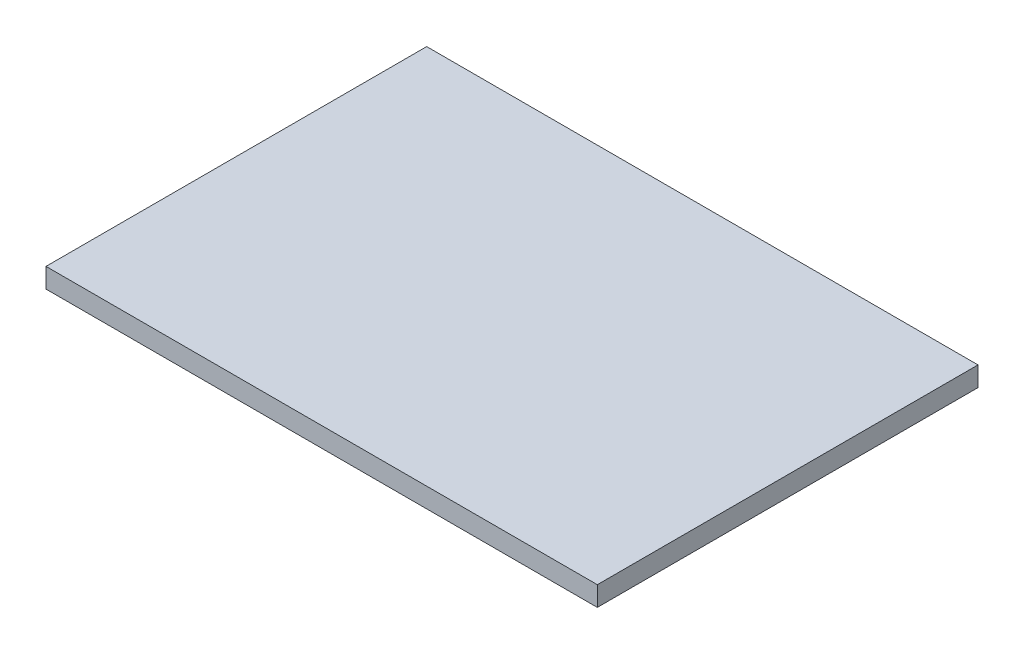
ISO-10303-21;
HEADER;
FILE_DESCRIPTION(('STEP AP214'),'2;1');
FILE_NAME('part.step','',(''),(''),'','','');
FILE_SCHEMA(('AUTOMOTIVE_DESIGN { 1 0 10303 214 1 1 1 1 }'));
ENDSEC;
DATA;
#1=APPLICATION_CONTEXT('core data for automotive mechanical design processes');
#2=APPLICATION_PROTOCOL_DEFINITION('international standard','automotive_design',2000,#1);
#3=PRODUCT_CONTEXT('',#1,'mechanical');
#4=PRODUCT('Part','Part','',(#3));
#5=PRODUCT_RELATED_PRODUCT_CATEGORY('part','',(#4));
#6=PRODUCT_DEFINITION_FORMATION('','',#4);
#7=PRODUCT_DEFINITION_CONTEXT('part definition',#1,'design');
#8=PRODUCT_DEFINITION('design','',#6,#7);
#9=PRODUCT_DEFINITION_SHAPE('','',#8);
#10=(LENGTH_UNIT() NAMED_UNIT(*) SI_UNIT(.MILLI.,.METRE.));
#11=(NAMED_UNIT(*) PLANE_ANGLE_UNIT() SI_UNIT($,.RADIAN.));
#12=(NAMED_UNIT(*) SI_UNIT($,.STERADIAN.) SOLID_ANGLE_UNIT());
#13=UNCERTAINTY_MEASURE_WITH_UNIT(LENGTH_MEASURE(1.E-05),#10,'distance_accuracy_value','');
#14=(GEOMETRIC_REPRESENTATION_CONTEXT(3) GLOBAL_UNCERTAINTY_ASSIGNED_CONTEXT((#13)) GLOBAL_UNIT_ASSIGNED_CONTEXT((#10,
#11,#12)) REPRESENTATION_CONTEXT('',''));
#15=CARTESIAN_POINT('',(0.,0.,0.));
#16=DIRECTION('',(0.,0.,1.));
#17=DIRECTION('',(1.,0.,0.));
#18=AXIS2_PLACEMENT_3D('',#15,#16,#17);
#19=CARTESIAN_POINT('',(533.4,38.1,368.3));
#20=DIRECTION('',(-1.,0.,0.));
#21=DIRECTION('',(0.,0.,1.));
#22=AXIS2_PLACEMENT_3D('',#19,#20,#21);
#23=PLANE('',#22);
#24=DIRECTION('',(0.,0.,-1.));
#25=VECTOR('',#24,1.);
#26=CARTESIAN_POINT('',(533.4,0.,368.3));
#27=LINE('',#26,#25);
#28=CARTESIAN_POINT('',(533.4,0.,368.3));
#29=VERTEX_POINT('',#28);
#30=CARTESIAN_POINT('',(533.4,0.,-368.3));
#31=VERTEX_POINT('',#30);
#32=EDGE_CURVE('E104',#29,#31,#27,.T.);
#33=ORIENTED_EDGE('',*,*,#32,.T.);
#34=DIRECTION('',(0.,-1.,0.));
#35=VECTOR('',#34,1.);
#36=CARTESIAN_POINT('',(533.4,38.1,-368.3));
#37=LINE('',#36,#35);
#38=CARTESIAN_POINT('',(533.4,38.1,-368.3));
#39=VERTEX_POINT('',#38);
#40=EDGE_CURVE('E11',#39,#31,#37,.T.);
#41=ORIENTED_EDGE('',*,*,#40,.F.);
#42=DIRECTION('',(0.,0.,-1.));
#43=VECTOR('',#42,1.);
#44=CARTESIAN_POINT('',(533.4,38.1,368.3));
#45=LINE('',#44,#43);
#46=CARTESIAN_POINT('',(533.4,38.1,368.3));
#47=VERTEX_POINT('',#46);
#48=EDGE_CURVE('E92',#47,#39,#45,.T.);
#49=ORIENTED_EDGE('',*,*,#48,.F.);
#50=DIRECTION('',(0.,-1.,0.));
#51=VECTOR('',#50,1.);
#52=CARTESIAN_POINT('',(533.4,38.1,368.3));
#53=LINE('',#52,#51);
#54=EDGE_CURVE('E100',#47,#29,#53,.T.);
#55=ORIENTED_EDGE('',*,*,#54,.T.);
#56=EDGE_LOOP('',(#33,#41,#49,#55));
#57=FACE_BOUND('',#56,.T.);
#58=ADVANCED_FACE('F41',(#57),#23,.F.);
#59=CARTESIAN_POINT('',(-533.4,38.1,-368.3));
#60=DIRECTION('',(0.,0.,1.));
#61=DIRECTION('',(1.,0.,0.));
#62=AXIS2_PLACEMENT_3D('',#59,#60,#61);
#63=PLANE('',#62);
#64=DIRECTION('',(-1.,0.,0.));
#65=VECTOR('',#64,1.);
#66=CARTESIAN_POINT('',(-533.4,0.,-368.3));
#67=LINE('',#66,#65);
#68=CARTESIAN_POINT('',(-533.4,0.,-368.3));
#69=VERTEX_POINT('',#68);
#70=EDGE_CURVE('E96',#31,#69,#67,.T.);
#71=ORIENTED_EDGE('',*,*,#70,.T.);
#72=DIRECTION('',(0.,-1.,0.));
#73=VECTOR('',#72,1.);
#74=CARTESIAN_POINT('',(-533.4,38.1,-368.3));
#75=LINE('',#74,#73);
#76=CARTESIAN_POINT('',(-533.4,38.1,-368.3));
#77=VERTEX_POINT('',#76);
#78=EDGE_CURVE('E49',#77,#69,#75,.T.);
#79=ORIENTED_EDGE('',*,*,#78,.F.);
#80=DIRECTION('',(-1.,0.,0.));
#81=VECTOR('',#80,1.);
#82=CARTESIAN_POINT('',(-533.4,38.1,-368.3));
#83=LINE('',#82,#81);
#84=EDGE_CURVE('E87',#39,#77,#83,.T.);
#85=ORIENTED_EDGE('',*,*,#84,.F.);
#86=ORIENTED_EDGE('',*,*,#40,.T.);
#87=EDGE_LOOP('',(#71,#79,#85,#86));
#88=FACE_BOUND('',#87,.T.);
#89=ADVANCED_FACE('F95',(#88),#63,.F.);
#90=CARTESIAN_POINT('',(-533.4,38.1,368.3));
#91=DIRECTION('',(1.,0.,0.));
#92=DIRECTION('',(0.,0.,-1.));
#93=AXIS2_PLACEMENT_3D('',#90,#91,#92);
#94=PLANE('',#93);
#95=DIRECTION('',(0.,0.,1.));
#96=VECTOR('',#95,1.);
#97=CARTESIAN_POINT('',(-533.4,0.,368.3));
#98=LINE('',#97,#96);
#99=CARTESIAN_POINT('',(-533.4,0.,368.3));
#100=VERTEX_POINT('',#99);
#101=EDGE_CURVE('E74',#69,#100,#98,.T.);
#102=ORIENTED_EDGE('',*,*,#101,.T.);
#103=DIRECTION('',(0.,-1.,0.));
#104=VECTOR('',#103,1.);
#105=CARTESIAN_POINT('',(-533.4,38.1,368.3));
#106=LINE('',#105,#104);
#107=CARTESIAN_POINT('',(-533.4,38.1,368.3));
#108=VERTEX_POINT('',#107);
#109=EDGE_CURVE('E97',#108,#100,#106,.T.);
#110=ORIENTED_EDGE('',*,*,#109,.F.);
#111=DIRECTION('',(0.,0.,1.));
#112=VECTOR('',#111,1.);
#113=CARTESIAN_POINT('',(-533.4,38.1,368.3));
#114=LINE('',#113,#112);
#115=EDGE_CURVE('E90',#77,#108,#114,.T.);
#116=ORIENTED_EDGE('',*,*,#115,.F.);
#117=ORIENTED_EDGE('',*,*,#78,.T.);
#118=EDGE_LOOP('',(#102,#110,#116,#117));
#119=FACE_BOUND('',#118,.T.);
#120=ADVANCED_FACE('F98',(#119),#94,.F.);
#121=CARTESIAN_POINT('',(-533.4,38.1,368.3));
#122=DIRECTION('',(0.,0.,-1.));
#123=DIRECTION('',(-1.,0.,0.));
#124=AXIS2_PLACEMENT_3D('',#121,#122,#123);
#125=PLANE('',#124);
#126=DIRECTION('',(1.,0.,0.));
#127=VECTOR('',#126,1.);
#128=CARTESIAN_POINT('',(-533.4,0.,368.3));
#129=LINE('',#128,#127);
#130=EDGE_CURVE('E80',#100,#29,#129,.T.);
#131=ORIENTED_EDGE('',*,*,#130,.T.);
#132=ORIENTED_EDGE('',*,*,#54,.F.);
#133=DIRECTION('',(1.,0.,0.));
#134=VECTOR('',#133,1.);
#135=CARTESIAN_POINT('',(-533.4,38.1,368.3));
#136=LINE('',#135,#134);
#137=EDGE_CURVE('E57',#108,#47,#136,.T.);
#138=ORIENTED_EDGE('',*,*,#137,.F.);
#139=ORIENTED_EDGE('',*,*,#109,.T.);
#140=EDGE_LOOP('',(#131,#132,#138,#139));
#141=FACE_BOUND('',#140,.T.);
#142=ADVANCED_FACE('F111',(#141),#125,.F.);
#143=CARTESIAN_POINT('',(0.,38.1,0.));
#144=DIRECTION('',(0.,-1.,0.));
#145=DIRECTION('',(0.,0.,-1.));
#146=AXIS2_PLACEMENT_3D('',#143,#144,#145);
#147=PLANE('',#146);
#148=ORIENTED_EDGE('',*,*,#48,.T.);
#149=ORIENTED_EDGE('',*,*,#84,.T.);
#150=ORIENTED_EDGE('',*,*,#115,.T.);
#151=ORIENTED_EDGE('',*,*,#137,.T.);
#152=EDGE_LOOP('',(#148,#149,#150,#151));
#153=FACE_BOUND('',#152,.T.);
#154=ADVANCED_FACE('F88',(#153),#147,.F.);
#155=CARTESIAN_POINT('',(0.,0.,0.));
#156=DIRECTION('',(0.,-1.,0.));
#157=DIRECTION('',(0.,0.,-1.));
#158=AXIS2_PLACEMENT_3D('',#155,#156,#157);
#159=PLANE('',#158);
#160=ORIENTED_EDGE('',*,*,#32,.F.);
#161=ORIENTED_EDGE('',*,*,#130,.F.);
#162=ORIENTED_EDGE('',*,*,#101,.F.);
#163=ORIENTED_EDGE('',*,*,#70,.F.);
#164=EDGE_LOOP('',(#160,#161,#162,#163));
#165=FACE_BOUND('',#164,.T.);
#166=ADVANCED_FACE('F114',(#165),#159,.T.);
#167=CLOSED_SHELL('',(#58,#89,#120,#142,#154,#166));
#168=MANIFOLD_SOLID_BREP('B2',#167);
#169=ADVANCED_BREP_SHAPE_REPRESENTATION('',(#18,#168),#14);
#170=SHAPE_DEFINITION_REPRESENTATION(#9,#169);
ENDSEC;
END-ISO-10303-21;
